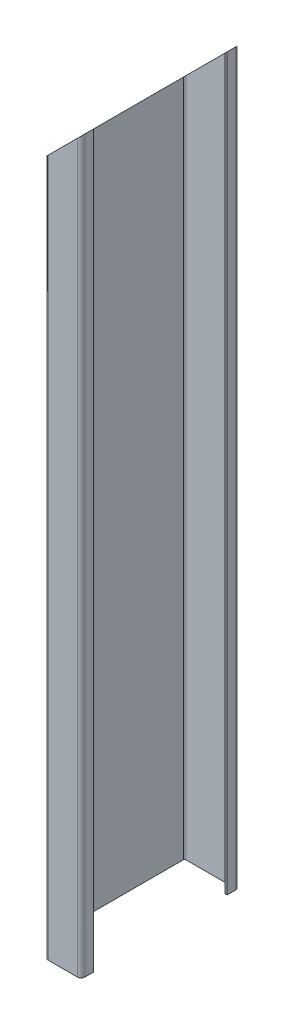
ISO-10303-21;
HEADER;
FILE_DESCRIPTION(('STEP AP214'),'2;1');
FILE_NAME('part.step','',(''),(''),'','','');
FILE_SCHEMA(('AUTOMOTIVE_DESIGN { 1 0 10303 214 1 1 1 1 }'));
ENDSEC;
DATA;
#1=APPLICATION_CONTEXT('core data for automotive mechanical design processes');
#2=APPLICATION_PROTOCOL_DEFINITION('international standard','automotive_design',2000,#1);
#3=PRODUCT_CONTEXT('',#1,'mechanical');
#4=PRODUCT('Part','Part','',(#3));
#5=PRODUCT_RELATED_PRODUCT_CATEGORY('part','',(#4));
#6=PRODUCT_DEFINITION_FORMATION('','',#4);
#7=PRODUCT_DEFINITION_CONTEXT('part definition',#1,'design');
#8=PRODUCT_DEFINITION('design','',#6,#7);
#9=PRODUCT_DEFINITION_SHAPE('','',#8);
#10=(LENGTH_UNIT() NAMED_UNIT(*) SI_UNIT(.MILLI.,.METRE.));
#11=(NAMED_UNIT(*) PLANE_ANGLE_UNIT() SI_UNIT($,.RADIAN.));
#12=(NAMED_UNIT(*) SI_UNIT($,.STERADIAN.) SOLID_ANGLE_UNIT());
#13=UNCERTAINTY_MEASURE_WITH_UNIT(LENGTH_MEASURE(1.E-05),#10,'distance_accuracy_value','');
#14=(GEOMETRIC_REPRESENTATION_CONTEXT(3) GLOBAL_UNCERTAINTY_ASSIGNED_CONTEXT((#13)) GLOBAL_UNIT_ASSIGNED_CONTEXT((#10,
#11,#12)) REPRESENTATION_CONTEXT('',''));
#15=CARTESIAN_POINT('',(0.,0.,0.));
#16=DIRECTION('',(0.,0.,1.));
#17=DIRECTION('',(1.,0.,0.));
#18=AXIS2_PLACEMENT_3D('',#15,#16,#17);
#19=CARTESIAN_POINT('',(20.5,600.,-62.));
#20=DIRECTION('',(1.,0.,0.));
#21=DIRECTION('',(0.,0.,-1.));
#22=AXIS2_PLACEMENT_3D('',#19,#20,#21);
#23=PLANE('',#22);
#24=DIRECTION('',(0.,-1.,0.));
#25=VECTOR('',#24,1.);
#26=CARTESIAN_POINT('',(20.5,600.,-55.));
#27=LINE('',#26,#25);
#28=CARTESIAN_POINT('',(20.5,598.,-55.));
#29=VERTEX_POINT('',#28);
#30=CARTESIAN_POINT('',(20.5,0.,-55.));
#31=VERTEX_POINT('',#30);
#32=EDGE_CURVE('E11',#29,#31,#27,.T.);
#33=ORIENTED_EDGE('',*,*,#32,.F.);
#34=DIRECTION('',(0.,0.,-1.));
#35=VECTOR('',#34,1.);
#36=CARTESIAN_POINT('',(20.5,598.,-62.));
#37=LINE('',#36,#35);
#38=CARTESIAN_POINT('',(20.5,598.,-62.));
#39=VERTEX_POINT('',#38);
#40=EDGE_CURVE('E512',#29,#39,#37,.T.);
#41=ORIENTED_EDGE('',*,*,#40,.T.);
#42=DIRECTION('',(0.,-1.,0.));
#43=VECTOR('',#42,1.);
#44=CARTESIAN_POINT('',(20.5,600.,-62.));
#45=LINE('',#44,#43);
#46=CARTESIAN_POINT('',(20.5,0.,-62.));
#47=VERTEX_POINT('',#46);
#48=EDGE_CURVE('E152',#39,#47,#45,.T.);
#49=ORIENTED_EDGE('',*,*,#48,.T.);
#50=DIRECTION('',(0.,0.,-1.));
#51=VECTOR('',#50,1.);
#52=CARTESIAN_POINT('',(20.5,0.,-62.));
#53=LINE('',#52,#51);
#54=EDGE_CURVE('E166',#47,#31,#53,.F.);
#55=ORIENTED_EDGE('',*,*,#54,.T.);
#56=EDGE_LOOP('',(#33,#41,#49,#55));
#57=FACE_BOUND('',#56,.T.);
#58=ADVANCED_FACE('F35',(#57),#23,.F.);
#59=CARTESIAN_POINT('',(22.5,600.,-55.));
#60=DIRECTION('',(0.,0.,1.));
#61=DIRECTION('',(1.,0.,0.));
#62=AXIS2_PLACEMENT_3D('',#59,#60,#61);
#63=PLANE('',#62);
#64=DIRECTION('',(0.707106781186547,0.707106781186548,0.));
#65=VECTOR('',#64,1.);
#66=CARTESIAN_POINT('',(22.5,600.,-55.));
#67=LINE('',#66,#65);
#68=CARTESIAN_POINT('',(22.5,600.,-55.));
#69=VERTEX_POINT('',#68);
#70=EDGE_CURVE('E513',#29,#69,#67,.T.);
#71=ORIENTED_EDGE('',*,*,#70,.F.);
#72=ORIENTED_EDGE('',*,*,#32,.T.);
#73=DIRECTION('',(-1.,0.,0.));
#74=VECTOR('',#73,1.);
#75=CARTESIAN_POINT('',(22.5,0.,-55.));
#76=LINE('',#75,#74);
#77=CARTESIAN_POINT('',(22.5,0.,-55.));
#78=VERTEX_POINT('',#77);
#79=EDGE_CURVE('E234',#78,#31,#76,.T.);
#80=ORIENTED_EDGE('',*,*,#79,.F.);
#81=DIRECTION('',(0.,-1.,0.));
#82=VECTOR('',#81,1.);
#83=CARTESIAN_POINT('',(22.5,600.,-55.));
#84=LINE('',#83,#82);
#85=EDGE_CURVE('E43',#69,#78,#84,.T.);
#86=ORIENTED_EDGE('',*,*,#85,.F.);
#87=EDGE_LOOP('',(#71,#72,#80,#86));
#88=FACE_BOUND('',#87,.T.);
#89=ADVANCED_FACE('F235',(#88),#63,.T.);
#90=CARTESIAN_POINT('',(22.5,600.,-62.));
#91=DIRECTION('',(1.,0.,0.));
#92=DIRECTION('',(0.,0.,-1.));
#93=AXIS2_PLACEMENT_3D('',#90,#91,#92);
#94=PLANE('',#93);
#95=DIRECTION('',(0.,0.,1.));
#96=VECTOR('',#95,1.);
#97=CARTESIAN_POINT('',(22.5,0.,-62.));
#98=LINE('',#97,#96);
#99=CARTESIAN_POINT('',(22.5,0.,-62.));
#100=VERTEX_POINT('',#99);
#101=EDGE_CURVE('E228',#100,#78,#98,.T.);
#102=ORIENTED_EDGE('',*,*,#101,.F.);
#103=DIRECTION('',(0.,-1.,0.));
#104=VECTOR('',#103,1.);
#105=CARTESIAN_POINT('',(22.5,600.,-62.));
#106=LINE('',#105,#104);
#107=CARTESIAN_POINT('',(22.5,600.,-62.));
#108=VERTEX_POINT('',#107);
#109=EDGE_CURVE('E220',#108,#100,#106,.T.);
#110=ORIENTED_EDGE('',*,*,#109,.F.);
#111=DIRECTION('',(0.,0.,1.));
#112=VECTOR('',#111,1.);
#113=CARTESIAN_POINT('',(22.5,600.,-62.));
#114=LINE('',#113,#112);
#115=EDGE_CURVE('E167',#108,#69,#114,.T.);
#116=ORIENTED_EDGE('',*,*,#115,.T.);
#117=ORIENTED_EDGE('',*,*,#85,.T.);
#118=EDGE_LOOP('',(#102,#110,#116,#117));
#119=FACE_BOUND('',#118,.T.);
#120=ADVANCED_FACE('F225',(#119),#94,.T.);
#121=CARTESIAN_POINT('',(19.5,600.,-62.));
#122=DIRECTION('',(0.,-1.,0.));
#123=DIRECTION('',(0.,0.,-1.));
#124=AXIS2_PLACEMENT_3D('',#121,#122,#123);
#125=CYLINDRICAL_SURFACE('',#124,3.);
#126=CARTESIAN_POINT('',(19.5,597.,-62.));
#127=DIRECTION('',(0.707106781186548,-0.707106781186547,0.));
#128=DIRECTION('',(-0.707106781186547,-0.707106781186548,0.));
#129=AXIS2_PLACEMENT_3D('',#126,#127,#128);
#130=ELLIPSE('',#129,4.24264068711929,3.);
#131=CARTESIAN_POINT('',(19.5,597.,-65.));
#132=VERTEX_POINT('',#131);
#133=EDGE_CURVE('E464',#108,#132,#130,.F.);
#134=ORIENTED_EDGE('',*,*,#133,.F.);
#135=ORIENTED_EDGE('',*,*,#109,.T.);
#136=CARTESIAN_POINT('',(19.5,0.,-62.));
#137=DIRECTION('',(0.,-1.,0.));
#138=DIRECTION('',(0.,0.,-1.));
#139=AXIS2_PLACEMENT_3D('',#136,#137,#138);
#140=CIRCLE('',#139,3.);
#141=CARTESIAN_POINT('',(19.5,0.,-65.));
#142=VERTEX_POINT('',#141);
#143=EDGE_CURVE('E240',#142,#100,#140,.T.);
#144=ORIENTED_EDGE('',*,*,#143,.F.);
#145=DIRECTION('',(0.,-1.,0.));
#146=VECTOR('',#145,1.);
#147=CARTESIAN_POINT('',(19.5,600.,-65.));
#148=LINE('',#147,#146);
#149=EDGE_CURVE('E218',#132,#142,#148,.T.);
#150=ORIENTED_EDGE('',*,*,#149,.F.);
#151=EDGE_LOOP('',(#134,#135,#144,#150));
#152=FACE_BOUND('',#151,.T.);
#153=ADVANCED_FACE('F461',(#152),#125,.T.);
#154=CARTESIAN_POINT('',(-19.5,600.,-65.));
#155=DIRECTION('',(0.,0.,-1.));
#156=DIRECTION('',(-1.,0.,0.));
#157=AXIS2_PLACEMENT_3D('',#154,#155,#156);
#158=PLANE('',#157);
#159=DIRECTION('',(0.707106781186547,0.707106781186548,0.));
#160=VECTOR('',#159,1.);
#161=CARTESIAN_POINT('',(-22.5,555.,-65.));
#162=LINE('',#161,#160);
#163=CARTESIAN_POINT('',(-19.5,558.,-65.));
#164=VERTEX_POINT('',#163);
#165=EDGE_CURVE('E458',#164,#132,#162,.T.);
#166=ORIENTED_EDGE('',*,*,#165,.T.);
#167=ORIENTED_EDGE('',*,*,#149,.T.);
#168=DIRECTION('',(1.,0.,0.));
#169=VECTOR('',#168,1.);
#170=CARTESIAN_POINT('',(-19.5,0.,-65.));
#171=LINE('',#170,#169);
#172=CARTESIAN_POINT('',(-19.5,0.,-65.));
#173=VERTEX_POINT('',#172);
#174=EDGE_CURVE('E242',#173,#142,#171,.T.);
#175=ORIENTED_EDGE('',*,*,#174,.F.);
#176=DIRECTION('',(0.,-1.,0.));
#177=VECTOR('',#176,1.);
#178=CARTESIAN_POINT('',(-19.5,600.,-65.));
#179=LINE('',#178,#177);
#180=EDGE_CURVE('E216',#164,#173,#179,.T.);
#181=ORIENTED_EDGE('',*,*,#180,.F.);
#182=EDGE_LOOP('',(#166,#167,#175,#181));
#183=FACE_BOUND('',#182,.T.);
#184=ADVANCED_FACE('F453',(#183),#158,.T.);
#185=CARTESIAN_POINT('',(-19.5,600.,-62.));
#186=DIRECTION('',(0.,-1.,0.));
#187=DIRECTION('',(0.,0.,-1.));
#188=AXIS2_PLACEMENT_3D('',#185,#186,#187);
#189=CYLINDRICAL_SURFACE('',#188,3.);
#190=CARTESIAN_POINT('',(-19.5,558.,-62.));
#191=DIRECTION('',(0.707106781186548,-0.707106781186547,0.));
#192=DIRECTION('',(-0.707106781186547,-0.707106781186548,0.));
#193=AXIS2_PLACEMENT_3D('',#190,#191,#192);
#194=ELLIPSE('',#193,4.24264068711929,3.);
#195=CARTESIAN_POINT('',(-22.5,555.,-62.));
#196=VERTEX_POINT('',#195);
#197=EDGE_CURVE('E502',#164,#196,#194,.F.);
#198=ORIENTED_EDGE('',*,*,#197,.F.);
#199=ORIENTED_EDGE('',*,*,#180,.T.);
#200=CARTESIAN_POINT('',(-19.5,0.,-62.));
#201=DIRECTION('',(0.,-1.,0.));
#202=DIRECTION('',(0.,0.,-1.));
#203=AXIS2_PLACEMENT_3D('',#200,#201,#202);
#204=CIRCLE('',#203,3.);
#205=CARTESIAN_POINT('',(-22.5,0.,-62.));
#206=VERTEX_POINT('',#205);
#207=EDGE_CURVE('E247',#206,#173,#204,.T.);
#208=ORIENTED_EDGE('',*,*,#207,.F.);
#209=DIRECTION('',(0.,-1.,0.));
#210=VECTOR('',#209,1.);
#211=CARTESIAN_POINT('',(-22.5,600.,-62.));
#212=LINE('',#211,#210);
#213=EDGE_CURVE('E214',#196,#206,#212,.T.);
#214=ORIENTED_EDGE('',*,*,#213,.F.);
#215=EDGE_LOOP('',(#198,#199,#208,#214));
#216=FACE_BOUND('',#215,.T.);
#217=ADVANCED_FACE('F448',(#216),#189,.T.);
#218=CARTESIAN_POINT('',(-22.5,600.,27.));
#219=DIRECTION('',(-1.,0.,0.));
#220=DIRECTION('',(0.,0.,1.));
#221=AXIS2_PLACEMENT_3D('',#218,#219,#220);
#222=PLANE('',#221);
#223=DIRECTION('',(0.,0.,1.));
#224=VECTOR('',#223,1.);
#225=CARTESIAN_POINT('',(-22.5,555.,-128.639610306789));
#226=LINE('',#225,#224);
#227=CARTESIAN_POINT('',(-22.5,555.,27.));
#228=VERTEX_POINT('',#227);
#229=EDGE_CURVE('E445',#196,#228,#226,.T.);
#230=ORIENTED_EDGE('',*,*,#229,.F.);
#231=ORIENTED_EDGE('',*,*,#213,.T.);
#232=DIRECTION('',(0.,0.,-1.));
#233=VECTOR('',#232,1.);
#234=CARTESIAN_POINT('',(-22.5,0.,27.));
#235=LINE('',#234,#233);
#236=CARTESIAN_POINT('',(-22.5,0.,27.));
#237=VERTEX_POINT('',#236);
#238=EDGE_CURVE('E250',#237,#206,#235,.T.);
#239=ORIENTED_EDGE('',*,*,#238,.F.);
#240=DIRECTION('',(0.,-1.,0.));
#241=VECTOR('',#240,1.);
#242=CARTESIAN_POINT('',(-22.5,600.,27.));
#243=LINE('',#242,#241);
#244=EDGE_CURVE('E212',#228,#237,#243,.T.);
#245=ORIENTED_EDGE('',*,*,#244,.F.);
#246=EDGE_LOOP('',(#230,#231,#239,#245));
#247=FACE_BOUND('',#246,.T.);
#248=ADVANCED_FACE('F440',(#247),#222,.T.);
#249=CARTESIAN_POINT('',(-19.5,600.,27.));
#250=DIRECTION('',(0.,-1.,0.));
#251=DIRECTION('',(0.,0.,-1.));
#252=AXIS2_PLACEMENT_3D('',#249,#250,#251);
#253=CYLINDRICAL_SURFACE('',#252,3.);
#254=CARTESIAN_POINT('',(-19.5,558.,27.));
#255=DIRECTION('',(0.707106781186548,-0.707106781186547,0.));
#256=DIRECTION('',(-0.707106781186547,-0.707106781186548,0.));
#257=AXIS2_PLACEMENT_3D('',#254,#255,#256);
#258=ELLIPSE('',#257,4.24264068711929,3.);
#259=CARTESIAN_POINT('',(-19.5,558.,30.));
#260=VERTEX_POINT('',#259);
#261=EDGE_CURVE('E437',#228,#260,#258,.F.);
#262=ORIENTED_EDGE('',*,*,#261,.F.);
#263=ORIENTED_EDGE('',*,*,#244,.T.);
#264=CARTESIAN_POINT('',(-19.5,0.,27.));
#265=DIRECTION('',(0.,-1.,0.));
#266=DIRECTION('',(0.,0.,-1.));
#267=AXIS2_PLACEMENT_3D('',#264,#265,#266);
#268=CIRCLE('',#267,3.);
#269=CARTESIAN_POINT('',(-19.5,0.,30.));
#270=VERTEX_POINT('',#269);
#271=EDGE_CURVE('E253',#270,#237,#268,.T.);
#272=ORIENTED_EDGE('',*,*,#271,.F.);
#273=DIRECTION('',(0.,-1.,0.));
#274=VECTOR('',#273,1.);
#275=CARTESIAN_POINT('',(-19.5,600.,30.));
#276=LINE('',#275,#274);
#277=EDGE_CURVE('E210',#260,#270,#276,.T.);
#278=ORIENTED_EDGE('',*,*,#277,.F.);
#279=EDGE_LOOP('',(#262,#263,#272,#278));
#280=FACE_BOUND('',#279,.T.);
#281=ADVANCED_FACE('F433',(#280),#253,.T.);
#282=CARTESIAN_POINT('',(-8.5,600.,30.));
#283=DIRECTION('',(0.,0.,1.));
#284=DIRECTION('',(1.,0.,0.));
#285=AXIS2_PLACEMENT_3D('',#282,#283,#284);
#286=PLANE('',#285);
#287=DIRECTION('',(0.707106781186547,0.707106781186548,0.));
#288=VECTOR('',#287,1.);
#289=CARTESIAN_POINT('',(7.00000000000001,584.5,30.));
#290=LINE('',#289,#288);
#291=CARTESIAN_POINT('',(-8.5,569.,30.));
#292=VERTEX_POINT('',#291);
#293=EDGE_CURVE('E499',#260,#292,#290,.T.);
#294=ORIENTED_EDGE('',*,*,#293,.F.);
#295=ORIENTED_EDGE('',*,*,#277,.T.);
#296=DIRECTION('',(-1.,0.,0.));
#297=VECTOR('',#296,1.);
#298=CARTESIAN_POINT('',(-8.5,0.,30.));
#299=LINE('',#298,#297);
#300=CARTESIAN_POINT('',(-8.5,0.,30.));
#301=VERTEX_POINT('',#300);
#302=EDGE_CURVE('E256',#301,#270,#299,.T.);
#303=ORIENTED_EDGE('',*,*,#302,.F.);
#304=DIRECTION('',(0.,-1.,0.));
#305=VECTOR('',#304,1.);
#306=CARTESIAN_POINT('',(-8.5,600.,30.));
#307=LINE('',#306,#305);
#308=EDGE_CURVE('E208',#292,#301,#307,.T.);
#309=ORIENTED_EDGE('',*,*,#308,.F.);
#310=EDGE_LOOP('',(#294,#295,#303,#309));
#311=FACE_BOUND('',#310,.T.);
#312=ADVANCED_FACE('F427',(#311),#286,.T.);
#313=CARTESIAN_POINT('',(-8.5,600.,31.));
#314=DIRECTION('',(0.,-1.,0.));
#315=DIRECTION('',(0.,0.,-1.));
#316=AXIS2_PLACEMENT_3D('',#313,#314,#315);
#317=CYLINDRICAL_SURFACE('',#316,1.);
#318=CARTESIAN_POINT('',(-8.5,569.,31.));
#319=DIRECTION('',(0.707106781186548,-0.707106781186547,0.));
#320=DIRECTION('',(-0.707106781186547,-0.707106781186548,0.));
#321=AXIS2_PLACEMENT_3D('',#318,#319,#320);
#322=ELLIPSE('',#321,1.4142135623731,1.);
#323=CARTESIAN_POINT('',(-7.5,570.,31.));
#324=VERTEX_POINT('',#323);
#325=EDGE_CURVE('E424',#292,#324,#322,.T.);
#326=ORIENTED_EDGE('',*,*,#325,.F.);
#327=ORIENTED_EDGE('',*,*,#308,.T.);
#328=CARTESIAN_POINT('',(-8.5,0.,31.));
#329=DIRECTION('',(0.,1.,0.));
#330=DIRECTION('',(0.,0.,1.));
#331=AXIS2_PLACEMENT_3D('',#328,#329,#330);
#332=CIRCLE('',#331,1.);
#333=CARTESIAN_POINT('',(-7.5,0.,31.));
#334=VERTEX_POINT('',#333);
#335=EDGE_CURVE('E259',#334,#301,#332,.T.);
#336=ORIENTED_EDGE('',*,*,#335,.F.);
#337=DIRECTION('',(0.,-1.,0.));
#338=VECTOR('',#337,1.);
#339=CARTESIAN_POINT('',(-7.5,600.,31.));
#340=LINE('',#339,#338);
#341=EDGE_CURVE('E206',#324,#334,#340,.T.);
#342=ORIENTED_EDGE('',*,*,#341,.F.);
#343=EDGE_LOOP('',(#326,#327,#336,#342));
#344=FACE_BOUND('',#343,.T.);
#345=ADVANCED_FACE('F419',(#344),#317,.F.);
#346=CARTESIAN_POINT('',(-7.5,600.,62.));
#347=DIRECTION('',(-1.,0.,0.));
#348=DIRECTION('',(0.,0.,1.));
#349=AXIS2_PLACEMENT_3D('',#346,#347,#348);
#350=PLANE('',#349);
#351=DIRECTION('',(0.,0.,1.));
#352=VECTOR('',#351,1.);
#353=CARTESIAN_POINT('',(-7.5,570.,62.));
#354=LINE('',#353,#352);
#355=CARTESIAN_POINT('',(-7.50000000000001,570.,62.));
#356=VERTEX_POINT('',#355);
#357=EDGE_CURVE('E416',#324,#356,#354,.T.);
#358=ORIENTED_EDGE('',*,*,#357,.F.);
#359=ORIENTED_EDGE('',*,*,#341,.T.);
#360=DIRECTION('',(0.,0.,-1.));
#361=VECTOR('',#360,1.);
#362=CARTESIAN_POINT('',(-7.5,0.,62.));
#363=LINE('',#362,#361);
#364=CARTESIAN_POINT('',(-7.50000000000001,0.,62.));
#365=VERTEX_POINT('',#364);
#366=EDGE_CURVE('E262',#365,#334,#363,.T.);
#367=ORIENTED_EDGE('',*,*,#366,.F.);
#368=DIRECTION('',(0.,-1.,0.));
#369=VECTOR('',#368,1.);
#370=CARTESIAN_POINT('',(-7.50000000000001,600.,62.));
#371=LINE('',#370,#369);
#372=EDGE_CURVE('E204',#356,#365,#371,.T.);
#373=ORIENTED_EDGE('',*,*,#372,.F.);
#374=EDGE_LOOP('',(#358,#359,#367,#373));
#375=FACE_BOUND('',#374,.T.);
#376=ADVANCED_FACE('F411',(#375),#350,.T.);
#377=CARTESIAN_POINT('',(-4.5,600.,62.));
#378=DIRECTION('',(0.,-1.,0.));
#379=DIRECTION('',(0.,0.,-1.));
#380=AXIS2_PLACEMENT_3D('',#377,#378,#379);
#381=CYLINDRICAL_SURFACE('',#380,3.);
#382=CARTESIAN_POINT('',(-4.5,573.,62.));
#383=DIRECTION('',(0.707106781186548,-0.707106781186547,0.));
#384=DIRECTION('',(-0.707106781186547,-0.707106781186548,0.));
#385=AXIS2_PLACEMENT_3D('',#382,#383,#384);
#386=ELLIPSE('',#385,4.24264068711929,3.);
#387=CARTESIAN_POINT('',(-4.50000000000001,573.,65.));
#388=VERTEX_POINT('',#387);
#389=EDGE_CURVE('E521',#356,#388,#386,.F.);
#390=ORIENTED_EDGE('',*,*,#389,.F.);
#391=ORIENTED_EDGE('',*,*,#372,.T.);
#392=CARTESIAN_POINT('',(-4.5,0.,62.));
#393=DIRECTION('',(0.,-1.,0.));
#394=DIRECTION('',(0.,0.,-1.));
#395=AXIS2_PLACEMENT_3D('',#392,#393,#394);
#396=CIRCLE('',#395,3.);
#397=CARTESIAN_POINT('',(-4.5,0.,65.));
#398=VERTEX_POINT('',#397);
#399=EDGE_CURVE('E265',#398,#365,#396,.T.);
#400=ORIENTED_EDGE('',*,*,#399,.F.);
#401=DIRECTION('',(0.,-1.,0.));
#402=VECTOR('',#401,1.);
#403=CARTESIAN_POINT('',(-4.5,600.,65.));
#404=LINE('',#403,#402);
#405=EDGE_CURVE('E202',#388,#398,#404,.T.);
#406=ORIENTED_EDGE('',*,*,#405,.F.);
#407=EDGE_LOOP('',(#390,#391,#400,#406));
#408=FACE_BOUND('',#407,.T.);
#409=ADVANCED_FACE('F405',(#408),#381,.T.);
#410=CARTESIAN_POINT('',(19.5,600.,65.));
#411=DIRECTION('',(0.,0.,1.));
#412=DIRECTION('',(1.,0.,0.));
#413=AXIS2_PLACEMENT_3D('',#410,#411,#412);
#414=PLANE('',#413);
#415=DIRECTION('',(0.707106781186547,0.707106781186548,0.));
#416=VECTOR('',#415,1.);
#417=CARTESIAN_POINT('',(-22.5,555.,65.));
#418=LINE('',#417,#416);
#419=CARTESIAN_POINT('',(19.5,597.,65.));
#420=VERTEX_POINT('',#419);
#421=EDGE_CURVE('E402',#388,#420,#418,.T.);
#422=ORIENTED_EDGE('',*,*,#421,.F.);
#423=ORIENTED_EDGE('',*,*,#405,.T.);
#424=DIRECTION('',(-1.,0.,0.));
#425=VECTOR('',#424,1.);
#426=CARTESIAN_POINT('',(19.5,0.,65.));
#427=LINE('',#426,#425);
#428=CARTESIAN_POINT('',(19.5,0.,65.));
#429=VERTEX_POINT('',#428);
#430=EDGE_CURVE('E268',#429,#398,#427,.T.);
#431=ORIENTED_EDGE('',*,*,#430,.F.);
#432=DIRECTION('',(0.,-1.,0.));
#433=VECTOR('',#432,1.);
#434=CARTESIAN_POINT('',(19.5,600.,65.));
#435=LINE('',#434,#433);
#436=EDGE_CURVE('E200',#420,#429,#435,.T.);
#437=ORIENTED_EDGE('',*,*,#436,.F.);
#438=EDGE_LOOP('',(#422,#423,#431,#437));
#439=FACE_BOUND('',#438,.T.);
#440=ADVANCED_FACE('F398',(#439),#414,.T.);
#441=CARTESIAN_POINT('',(19.5,600.,62.));
#442=DIRECTION('',(0.,-1.,0.));
#443=DIRECTION('',(0.,0.,-1.));
#444=AXIS2_PLACEMENT_3D('',#441,#442,#443);
#445=CYLINDRICAL_SURFACE('',#444,3.);
#446=CARTESIAN_POINT('',(19.5,597.,62.));
#447=DIRECTION('',(0.707106781186548,-0.707106781186547,0.));
#448=DIRECTION('',(-0.707106781186547,-0.707106781186548,0.));
#449=AXIS2_PLACEMENT_3D('',#446,#447,#448);
#450=ELLIPSE('',#449,4.24264068711929,3.);
#451=CARTESIAN_POINT('',(22.5,600.,62.));
#452=VERTEX_POINT('',#451);
#453=EDGE_CURVE('E50',#420,#452,#450,.F.);
#454=ORIENTED_EDGE('',*,*,#453,.F.);
#455=ORIENTED_EDGE('',*,*,#436,.T.);
#456=CARTESIAN_POINT('',(19.5,0.,62.));
#457=DIRECTION('',(0.,-1.,0.));
#458=DIRECTION('',(0.,0.,-1.));
#459=AXIS2_PLACEMENT_3D('',#456,#457,#458);
#460=CIRCLE('',#459,3.);
#461=CARTESIAN_POINT('',(22.5,0.,62.));
#462=VERTEX_POINT('',#461);
#463=EDGE_CURVE('E271',#462,#429,#460,.T.);
#464=ORIENTED_EDGE('',*,*,#463,.F.);
#465=DIRECTION('',(0.,-1.,0.));
#466=VECTOR('',#465,1.);
#467=CARTESIAN_POINT('',(22.5,600.,62.));
#468=LINE('',#467,#466);
#469=EDGE_CURVE('E198',#452,#462,#468,.T.);
#470=ORIENTED_EDGE('',*,*,#469,.F.);
#471=EDGE_LOOP('',(#454,#455,#464,#470));
#472=FACE_BOUND('',#471,.T.);
#473=ADVANCED_FACE('F393',(#472),#445,.T.);
#474=CARTESIAN_POINT('',(22.5,600.,55.));
#475=DIRECTION('',(1.,0.,0.));
#476=DIRECTION('',(0.,0.,-1.));
#477=AXIS2_PLACEMENT_3D('',#474,#475,#476);
#478=PLANE('',#477);
#479=DIRECTION('',(0.,0.,1.));
#480=VECTOR('',#479,1.);
#481=CARTESIAN_POINT('',(22.5,0.,55.));
#482=LINE('',#481,#480);
#483=CARTESIAN_POINT('',(22.5,0.,55.));
#484=VERTEX_POINT('',#483);
#485=EDGE_CURVE('E274',#484,#462,#482,.T.);
#486=ORIENTED_EDGE('',*,*,#485,.F.);
#487=DIRECTION('',(0.,-1.,0.));
#488=VECTOR('',#487,1.);
#489=CARTESIAN_POINT('',(22.5,600.,55.));
#490=LINE('',#489,#488);
#491=CARTESIAN_POINT('',(22.5,600.,55.));
#492=VERTEX_POINT('',#491);
#493=EDGE_CURVE('E196',#492,#484,#490,.T.);
#494=ORIENTED_EDGE('',*,*,#493,.F.);
#495=DIRECTION('',(0.,0.,1.));
#496=VECTOR('',#495,1.);
#497=CARTESIAN_POINT('',(22.5,600.,55.));
#498=LINE('',#497,#496);
#499=EDGE_CURVE('E170',#492,#452,#498,.T.);
#500=ORIENTED_EDGE('',*,*,#499,.T.);
#501=ORIENTED_EDGE('',*,*,#469,.T.);
#502=EDGE_LOOP('',(#486,#494,#500,#501));
#503=FACE_BOUND('',#502,.T.);
#504=ADVANCED_FACE('F389',(#503),#478,.T.);
#505=CARTESIAN_POINT('',(20.5,600.,55.));
#506=DIRECTION('',(0.,0.,-1.));
#507=DIRECTION('',(-1.,0.,0.));
#508=AXIS2_PLACEMENT_3D('',#505,#506,#507);
#509=PLANE('',#508);
#510=DIRECTION('',(-0.707106781186547,-0.707106781186548,0.));
#511=VECTOR('',#510,1.);
#512=CARTESIAN_POINT('',(21.5,599.,55.));
#513=LINE('',#512,#511);
#514=CARTESIAN_POINT('',(20.5,598.,55.));
#515=VERTEX_POINT('',#514);
#516=EDGE_CURVE('E386',#492,#515,#513,.T.);
#517=ORIENTED_EDGE('',*,*,#516,.F.);
#518=ORIENTED_EDGE('',*,*,#493,.T.);
#519=DIRECTION('',(1.,0.,0.));
#520=VECTOR('',#519,1.);
#521=CARTESIAN_POINT('',(20.5,0.,55.));
#522=LINE('',#521,#520);
#523=CARTESIAN_POINT('',(20.5,0.,55.));
#524=VERTEX_POINT('',#523);
#525=EDGE_CURVE('E277',#524,#484,#522,.T.);
#526=ORIENTED_EDGE('',*,*,#525,.F.);
#527=DIRECTION('',(0.,-1.,0.));
#528=VECTOR('',#527,1.);
#529=CARTESIAN_POINT('',(20.5,600.,55.));
#530=LINE('',#529,#528);
#531=EDGE_CURVE('E194',#515,#524,#530,.T.);
#532=ORIENTED_EDGE('',*,*,#531,.F.);
#533=EDGE_LOOP('',(#517,#518,#526,#532));
#534=FACE_BOUND('',#533,.T.);
#535=ADVANCED_FACE('F380',(#534),#509,.T.);
#536=CARTESIAN_POINT('',(20.5,600.,55.));
#537=DIRECTION('',(1.,0.,0.));
#538=DIRECTION('',(0.,0.,-1.));
#539=AXIS2_PLACEMENT_3D('',#536,#537,#538);
#540=PLANE('',#539);
#541=DIRECTION('',(0.,-1.,0.));
#542=VECTOR('',#541,1.);
#543=CARTESIAN_POINT('',(20.5,600.,62.));
#544=LINE('',#543,#542);
#545=CARTESIAN_POINT('',(20.5,598.,62.));
#546=VERTEX_POINT('',#545);
#547=CARTESIAN_POINT('',(20.5,0.,62.));
#548=VERTEX_POINT('',#547);
#549=EDGE_CURVE('E192',#546,#548,#544,.T.);
#550=ORIENTED_EDGE('',*,*,#549,.F.);
#551=DIRECTION('',(0.,0.,-1.));
#552=VECTOR('',#551,1.);
#553=CARTESIAN_POINT('',(20.5,598.,55.));
#554=LINE('',#553,#552);
#555=EDGE_CURVE('E516',#546,#515,#554,.T.);
#556=ORIENTED_EDGE('',*,*,#555,.T.);
#557=ORIENTED_EDGE('',*,*,#531,.T.);
#558=DIRECTION('',(0.,0.,-1.));
#559=VECTOR('',#558,1.);
#560=CARTESIAN_POINT('',(20.5,0.,55.));
#561=LINE('',#560,#559);
#562=EDGE_CURVE('E280',#524,#548,#561,.F.);
#563=ORIENTED_EDGE('',*,*,#562,.T.);
#564=EDGE_LOOP('',(#550,#556,#557,#563));
#565=FACE_BOUND('',#564,.T.);
#566=ADVANCED_FACE('F375',(#565),#540,.F.);
#567=CARTESIAN_POINT('',(19.5,600.,62.));
#568=DIRECTION('',(0.,-1.,0.));
#569=DIRECTION('',(0.,0.,-1.));
#570=AXIS2_PLACEMENT_3D('',#567,#568,#569);
#571=CYLINDRICAL_SURFACE('',#570,1.);
#572=DIRECTION('',(0.,-1.,0.));
#573=VECTOR('',#572,1.);
#574=CARTESIAN_POINT('',(19.5,600.,63.));
#575=LINE('',#574,#573);
#576=CARTESIAN_POINT('',(19.5,597.,63.));
#577=VERTEX_POINT('',#576);
#578=CARTESIAN_POINT('',(19.5,0.,63.));
#579=VERTEX_POINT('',#578);
#580=EDGE_CURVE('E190',#577,#579,#575,.T.);
#581=ORIENTED_EDGE('',*,*,#580,.F.);
#582=CARTESIAN_POINT('',(19.5,597.,62.));
#583=DIRECTION('',(0.707106781186548,-0.707106781186547,0.));
#584=DIRECTION('',(-0.707106781186547,-0.707106781186548,0.));
#585=AXIS2_PLACEMENT_3D('',#582,#583,#584);
#586=ELLIPSE('',#585,1.4142135623731,1.);
#587=EDGE_CURVE('E372',#577,#546,#586,.F.);
#588=ORIENTED_EDGE('',*,*,#587,.T.);
#589=ORIENTED_EDGE('',*,*,#549,.T.);
#590=CARTESIAN_POINT('',(19.5,0.,62.));
#591=DIRECTION('',(0.,1.,0.));
#592=DIRECTION('',(1.,0.,0.));
#593=AXIS2_PLACEMENT_3D('',#590,#591,#592);
#594=CIRCLE('',#593,1.);
#595=EDGE_CURVE('E283',#548,#579,#594,.F.);
#596=ORIENTED_EDGE('',*,*,#595,.T.);
#597=EDGE_LOOP('',(#581,#588,#589,#596));
#598=FACE_BOUND('',#597,.T.);
#599=ADVANCED_FACE('F368',(#598),#571,.F.);
#600=CARTESIAN_POINT('',(19.5,600.,63.));
#601=DIRECTION('',(0.,0.,1.));
#602=DIRECTION('',(1.,0.,0.));
#603=AXIS2_PLACEMENT_3D('',#600,#601,#602);
#604=PLANE('',#603);
#605=DIRECTION('',(0.,-1.,0.));
#606=VECTOR('',#605,1.);
#607=CARTESIAN_POINT('',(-4.5,600.,63.));
#608=LINE('',#607,#606);
#609=CARTESIAN_POINT('',(-4.5,573.,63.));
#610=VERTEX_POINT('',#609);
#611=CARTESIAN_POINT('',(-4.5,0.,63.));
#612=VERTEX_POINT('',#611);
#613=EDGE_CURVE('E188',#610,#612,#608,.T.);
#614=ORIENTED_EDGE('',*,*,#613,.F.);
#615=DIRECTION('',(0.707106781186547,0.707106781186548,0.));
#616=VECTOR('',#615,1.);
#617=CARTESIAN_POINT('',(21.,598.5,63.));
#618=LINE('',#617,#616);
#619=EDGE_CURVE('E365',#610,#577,#618,.T.);
#620=ORIENTED_EDGE('',*,*,#619,.T.);
#621=ORIENTED_EDGE('',*,*,#580,.T.);
#622=DIRECTION('',(1.,0.,0.));
#623=VECTOR('',#622,1.);
#624=CARTESIAN_POINT('',(19.5,0.,63.));
#625=LINE('',#624,#623);
#626=EDGE_CURVE('E286',#579,#612,#625,.F.);
#627=ORIENTED_EDGE('',*,*,#626,.T.);
#628=EDGE_LOOP('',(#614,#620,#621,#627));
#629=FACE_BOUND('',#628,.T.);
#630=ADVANCED_FACE('F359',(#629),#604,.F.);
#631=CARTESIAN_POINT('',(-4.5,600.,62.));
#632=DIRECTION('',(0.,-1.,0.));
#633=DIRECTION('',(0.,0.,-1.));
#634=AXIS2_PLACEMENT_3D('',#631,#632,#633);
#635=CYLINDRICAL_SURFACE('',#634,1.);
#636=DIRECTION('',(0.,-1.,0.));
#637=VECTOR('',#636,1.);
#638=CARTESIAN_POINT('',(-5.5,600.,62.));
#639=LINE('',#638,#637);
#640=CARTESIAN_POINT('',(-5.5,572.,62.));
#641=VERTEX_POINT('',#640);
#642=CARTESIAN_POINT('',(-5.5,0.,62.));
#643=VERTEX_POINT('',#642);
#644=EDGE_CURVE('E186',#641,#643,#639,.T.);
#645=ORIENTED_EDGE('',*,*,#644,.F.);
#646=CARTESIAN_POINT('',(-4.5,573.,62.));
#647=DIRECTION('',(0.707106781186548,-0.707106781186547,0.));
#648=DIRECTION('',(-0.707106781186547,-0.707106781186548,0.));
#649=AXIS2_PLACEMENT_3D('',#646,#647,#648);
#650=ELLIPSE('',#649,1.4142135623731,1.);
#651=EDGE_CURVE('E537',#641,#610,#650,.F.);
#652=ORIENTED_EDGE('',*,*,#651,.T.);
#653=ORIENTED_EDGE('',*,*,#613,.T.);
#654=CARTESIAN_POINT('',(-4.5,0.,62.));
#655=DIRECTION('',(0.,1.,0.));
#656=DIRECTION('',(1.,0.,0.));
#657=AXIS2_PLACEMENT_3D('',#654,#655,#656);
#658=CIRCLE('',#657,1.);
#659=EDGE_CURVE('E289',#612,#643,#658,.F.);
#660=ORIENTED_EDGE('',*,*,#659,.T.);
#661=EDGE_LOOP('',(#645,#652,#653,#660));
#662=FACE_BOUND('',#661,.T.);
#663=ADVANCED_FACE('F353',(#662),#635,.F.);
#664=CARTESIAN_POINT('',(-5.5,600.,62.));
#665=DIRECTION('',(-1.,0.,0.));
#666=DIRECTION('',(0.,0.,1.));
#667=AXIS2_PLACEMENT_3D('',#664,#665,#666);
#668=PLANE('',#667);
#669=DIRECTION('',(0.,-1.,0.));
#670=VECTOR('',#669,1.);
#671=CARTESIAN_POINT('',(-5.5,600.,31.));
#672=LINE('',#671,#670);
#673=CARTESIAN_POINT('',(-5.5,572.,31.));
#674=VERTEX_POINT('',#673);
#675=CARTESIAN_POINT('',(-5.5,0.,31.));
#676=VERTEX_POINT('',#675);
#677=EDGE_CURVE('E184',#674,#676,#672,.T.);
#678=ORIENTED_EDGE('',*,*,#677,.F.);
#679=DIRECTION('',(0.,0.,1.));
#680=VECTOR('',#679,1.);
#681=CARTESIAN_POINT('',(-5.5,572.,62.));
#682=LINE('',#681,#680);
#683=EDGE_CURVE('E350',#674,#641,#682,.T.);
#684=ORIENTED_EDGE('',*,*,#683,.T.);
#685=ORIENTED_EDGE('',*,*,#644,.T.);
#686=DIRECTION('',(0.,0.,-1.));
#687=VECTOR('',#686,1.);
#688=CARTESIAN_POINT('',(-5.5,0.,62.));
#689=LINE('',#688,#687);
#690=EDGE_CURVE('E292',#643,#676,#689,.T.);
#691=ORIENTED_EDGE('',*,*,#690,.T.);
#692=EDGE_LOOP('',(#678,#684,#685,#691));
#693=FACE_BOUND('',#692,.T.);
#694=ADVANCED_FACE('F346',(#693),#668,.F.);
#695=CARTESIAN_POINT('',(-8.5,600.,31.));
#696=DIRECTION('',(0.,-1.,0.));
#697=DIRECTION('',(0.,0.,-1.));
#698=AXIS2_PLACEMENT_3D('',#695,#696,#697);
#699=CYLINDRICAL_SURFACE('',#698,3.);
#700=DIRECTION('',(0.,-1.,0.));
#701=VECTOR('',#700,1.);
#702=CARTESIAN_POINT('',(-8.5,600.,28.));
#703=LINE('',#702,#701);
#704=CARTESIAN_POINT('',(-8.5,569.,28.));
#705=VERTEX_POINT('',#704);
#706=CARTESIAN_POINT('',(-8.5,0.,28.));
#707=VERTEX_POINT('',#706);
#708=EDGE_CURVE('E182',#705,#707,#703,.T.);
#709=ORIENTED_EDGE('',*,*,#708,.F.);
#710=CARTESIAN_POINT('',(-8.5,569.,31.));
#711=DIRECTION('',(0.707106781186548,-0.707106781186547,0.));
#712=DIRECTION('',(-0.707106781186547,-0.707106781186548,0.));
#713=AXIS2_PLACEMENT_3D('',#710,#711,#712);
#714=ELLIPSE('',#713,4.24264068711929,3.);
#715=EDGE_CURVE('E343',#705,#674,#714,.T.);
#716=ORIENTED_EDGE('',*,*,#715,.T.);
#717=ORIENTED_EDGE('',*,*,#677,.T.);
#718=CARTESIAN_POINT('',(-8.5,0.,31.));
#719=DIRECTION('',(0.,1.,0.));
#720=DIRECTION('',(1.,0.,0.));
#721=AXIS2_PLACEMENT_3D('',#718,#719,#720);
#722=CIRCLE('',#721,3.);
#723=EDGE_CURVE('E295',#676,#707,#722,.T.);
#724=ORIENTED_EDGE('',*,*,#723,.T.);
#725=EDGE_LOOP('',(#709,#716,#717,#724));
#726=FACE_BOUND('',#725,.T.);
#727=ADVANCED_FACE('F337',(#726),#699,.T.);
#728=CARTESIAN_POINT('',(-8.5,600.,28.));
#729=DIRECTION('',(0.,0.,1.));
#730=DIRECTION('',(1.,0.,0.));
#731=AXIS2_PLACEMENT_3D('',#728,#729,#730);
#732=PLANE('',#731);
#733=DIRECTION('',(0.,-1.,0.));
#734=VECTOR('',#733,1.);
#735=CARTESIAN_POINT('',(-19.5,600.,28.));
#736=LINE('',#735,#734);
#737=CARTESIAN_POINT('',(-19.5,558.,28.));
#738=VERTEX_POINT('',#737);
#739=CARTESIAN_POINT('',(-19.5,0.,28.));
#740=VERTEX_POINT('',#739);
#741=EDGE_CURVE('E180',#738,#740,#736,.T.);
#742=ORIENTED_EDGE('',*,*,#741,.F.);
#743=DIRECTION('',(0.707106781186547,0.707106781186548,0.));
#744=VECTOR('',#743,1.);
#745=CARTESIAN_POINT('',(7.00000000000001,584.5,28.));
#746=LINE('',#745,#744);
#747=EDGE_CURVE('E533',#738,#705,#746,.T.);
#748=ORIENTED_EDGE('',*,*,#747,.T.);
#749=ORIENTED_EDGE('',*,*,#708,.T.);
#750=DIRECTION('',(1.,0.,0.));
#751=VECTOR('',#750,1.);
#752=CARTESIAN_POINT('',(-8.5,0.,28.));
#753=LINE('',#752,#751);
#754=EDGE_CURVE('E298',#707,#740,#753,.F.);
#755=ORIENTED_EDGE('',*,*,#754,.T.);
#756=EDGE_LOOP('',(#742,#748,#749,#755));
#757=FACE_BOUND('',#756,.T.);
#758=ADVANCED_FACE('F331',(#757),#732,.F.);
#759=CARTESIAN_POINT('',(-19.5,600.,27.));
#760=DIRECTION('',(0.,-1.,0.));
#761=DIRECTION('',(0.,0.,-1.));
#762=AXIS2_PLACEMENT_3D('',#759,#760,#761);
#763=CYLINDRICAL_SURFACE('',#762,0.999999999999999);
#764=DIRECTION('',(0.,-1.,0.));
#765=VECTOR('',#764,1.);
#766=CARTESIAN_POINT('',(-20.5,600.,27.));
#767=LINE('',#766,#765);
#768=CARTESIAN_POINT('',(-20.5,557.,27.));
#769=VERTEX_POINT('',#768);
#770=CARTESIAN_POINT('',(-20.5,0.,27.));
#771=VERTEX_POINT('',#770);
#772=EDGE_CURVE('E178',#769,#771,#767,.T.);
#773=ORIENTED_EDGE('',*,*,#772,.F.);
#774=CARTESIAN_POINT('',(-19.5,558.,27.));
#775=DIRECTION('',(0.707106781186548,-0.707106781186547,0.));
#776=DIRECTION('',(-0.707106781186547,-0.707106781186548,0.));
#777=AXIS2_PLACEMENT_3D('',#774,#775,#776);
#778=ELLIPSE('',#777,1.41421356237309,0.999999999999999);
#779=EDGE_CURVE('E328',#769,#738,#778,.F.);
#780=ORIENTED_EDGE('',*,*,#779,.T.);
#781=ORIENTED_EDGE('',*,*,#741,.T.);
#782=CARTESIAN_POINT('',(-19.5,0.,27.));
#783=DIRECTION('',(0.,1.,0.));
#784=DIRECTION('',(1.,0.,0.));
#785=AXIS2_PLACEMENT_3D('',#782,#783,#784);
#786=CIRCLE('',#785,0.999999999999999);
#787=EDGE_CURVE('E301',#740,#771,#786,.F.);
#788=ORIENTED_EDGE('',*,*,#787,.T.);
#789=EDGE_LOOP('',(#773,#780,#781,#788));
#790=FACE_BOUND('',#789,.T.);
#791=ADVANCED_FACE('F324',(#790),#763,.F.);
#792=CARTESIAN_POINT('',(-20.5,600.,27.));
#793=DIRECTION('',(-1.,0.,0.));
#794=DIRECTION('',(0.,0.,1.));
#795=AXIS2_PLACEMENT_3D('',#792,#793,#794);
#796=PLANE('',#795);
#797=DIRECTION('',(0.,-1.,0.));
#798=VECTOR('',#797,1.);
#799=CARTESIAN_POINT('',(-20.5,600.,-62.));
#800=LINE('',#799,#798);
#801=CARTESIAN_POINT('',(-20.5,557.,-62.));
#802=VERTEX_POINT('',#801);
#803=CARTESIAN_POINT('',(-20.5,0.,-62.));
#804=VERTEX_POINT('',#803);
#805=EDGE_CURVE('E176',#802,#804,#800,.T.);
#806=ORIENTED_EDGE('',*,*,#805,.F.);
#807=DIRECTION('',(0.,0.,1.));
#808=VECTOR('',#807,1.);
#809=CARTESIAN_POINT('',(-20.5,557.,27.));
#810=LINE('',#809,#808);
#811=EDGE_CURVE('E321',#802,#769,#810,.T.);
#812=ORIENTED_EDGE('',*,*,#811,.T.);
#813=ORIENTED_EDGE('',*,*,#772,.T.);
#814=DIRECTION('',(0.,0.,-1.));
#815=VECTOR('',#814,1.);
#816=CARTESIAN_POINT('',(-20.5,0.,27.));
#817=LINE('',#816,#815);
#818=EDGE_CURVE('E304',#771,#804,#817,.T.);
#819=ORIENTED_EDGE('',*,*,#818,.T.);
#820=EDGE_LOOP('',(#806,#812,#813,#819));
#821=FACE_BOUND('',#820,.T.);
#822=ADVANCED_FACE('F315',(#821),#796,.F.);
#823=CARTESIAN_POINT('',(-19.5,600.,-62.));
#824=DIRECTION('',(0.,-1.,0.));
#825=DIRECTION('',(0.,0.,-1.));
#826=AXIS2_PLACEMENT_3D('',#823,#824,#825);
#827=CYLINDRICAL_SURFACE('',#826,1.);
#828=DIRECTION('',(0.,-1.,0.));
#829=VECTOR('',#828,1.);
#830=CARTESIAN_POINT('',(-19.5,600.,-63.));
#831=LINE('',#830,#829);
#832=CARTESIAN_POINT('',(-19.5,558.,-63.));
#833=VERTEX_POINT('',#832);
#834=CARTESIAN_POINT('',(-19.5,0.,-63.));
#835=VERTEX_POINT('',#834);
#836=EDGE_CURVE('E151',#833,#835,#831,.T.);
#837=ORIENTED_EDGE('',*,*,#836,.F.);
#838=CARTESIAN_POINT('',(-19.5,558.,-62.));
#839=DIRECTION('',(0.707106781186548,-0.707106781186547,0.));
#840=DIRECTION('',(-0.707106781186547,-0.707106781186548,0.));
#841=AXIS2_PLACEMENT_3D('',#838,#839,#840);
#842=ELLIPSE('',#841,1.4142135623731,1.);
#843=EDGE_CURVE('E529',#833,#802,#842,.F.);
#844=ORIENTED_EDGE('',*,*,#843,.T.);
#845=ORIENTED_EDGE('',*,*,#805,.T.);
#846=CARTESIAN_POINT('',(-19.5,0.,-62.));
#847=DIRECTION('',(0.,1.,0.));
#848=DIRECTION('',(1.,0.,0.));
#849=AXIS2_PLACEMENT_3D('',#846,#847,#848);
#850=CIRCLE('',#849,1.);
#851=EDGE_CURVE('E161',#804,#835,#850,.F.);
#852=ORIENTED_EDGE('',*,*,#851,.T.);
#853=EDGE_LOOP('',(#837,#844,#845,#852));
#854=FACE_BOUND('',#853,.T.);
#855=ADVANCED_FACE('F307',(#854),#827,.F.);
#856=CARTESIAN_POINT('',(-19.5,600.,-63.));
#857=DIRECTION('',(0.,0.,-1.));
#858=DIRECTION('',(-1.,0.,0.));
#859=AXIS2_PLACEMENT_3D('',#856,#857,#858);
#860=PLANE('',#859);
#861=DIRECTION('',(0.,-1.,0.));
#862=VECTOR('',#861,1.);
#863=CARTESIAN_POINT('',(19.5,600.,-63.));
#864=LINE('',#863,#862);
#865=CARTESIAN_POINT('',(19.5,597.,-63.));
#866=VERTEX_POINT('',#865);
#867=CARTESIAN_POINT('',(19.5,0.,-63.));
#868=VERTEX_POINT('',#867);
#869=EDGE_CURVE('E139',#866,#868,#864,.T.);
#870=ORIENTED_EDGE('',*,*,#869,.F.);
#871=DIRECTION('',(-0.707106781186547,-0.707106781186548,0.));
#872=VECTOR('',#871,1.);
#873=CARTESIAN_POINT('',(1.50000000000002,579.,-63.));
#874=LINE('',#873,#872);
#875=EDGE_CURVE('E527',#866,#833,#874,.T.);
#876=ORIENTED_EDGE('',*,*,#875,.T.);
#877=ORIENTED_EDGE('',*,*,#836,.T.);
#878=DIRECTION('',(1.,0.,0.));
#879=VECTOR('',#878,1.);
#880=CARTESIAN_POINT('',(-19.5,0.,-63.));
#881=LINE('',#880,#879);
#882=EDGE_CURVE('E155',#835,#868,#881,.T.);
#883=ORIENTED_EDGE('',*,*,#882,.T.);
#884=EDGE_LOOP('',(#870,#876,#877,#883));
#885=FACE_BOUND('',#884,.T.);
#886=ADVANCED_FACE('F156',(#885),#860,.F.);
#887=CARTESIAN_POINT('',(19.5,600.,-62.));
#888=DIRECTION('',(0.,-1.,0.));
#889=DIRECTION('',(0.,0.,-1.));
#890=AXIS2_PLACEMENT_3D('',#887,#888,#889);
#891=CYLINDRICAL_SURFACE('',#890,1.);
#892=ORIENTED_EDGE('',*,*,#48,.F.);
#893=CARTESIAN_POINT('',(19.5,597.,-62.));
#894=DIRECTION('',(0.707106781186548,-0.707106781186547,0.));
#895=DIRECTION('',(-0.707106781186547,-0.707106781186548,0.));
#896=AXIS2_PLACEMENT_3D('',#893,#894,#895);
#897=ELLIPSE('',#896,1.4142135623731,1.);
#898=EDGE_CURVE('E148',#39,#866,#897,.F.);
#899=ORIENTED_EDGE('',*,*,#898,.T.);
#900=ORIENTED_EDGE('',*,*,#869,.T.);
#901=CARTESIAN_POINT('',(19.5,0.,-62.));
#902=DIRECTION('',(0.,1.,0.));
#903=DIRECTION('',(1.,0.,0.));
#904=AXIS2_PLACEMENT_3D('',#901,#902,#903);
#905=CIRCLE('',#904,1.);
#906=EDGE_CURVE('E144',#868,#47,#905,.F.);
#907=ORIENTED_EDGE('',*,*,#906,.T.);
#908=EDGE_LOOP('',(#892,#899,#900,#907));
#909=FACE_BOUND('',#908,.T.);
#910=ADVANCED_FACE('F142',(#909),#891,.F.);
#911=CARTESIAN_POINT('',(19.5,0.,-62.));
#912=DIRECTION('',(0.,-1.,0.));
#913=DIRECTION('',(-1.,0.,0.));
#914=AXIS2_PLACEMENT_3D('',#911,#912,#913);
#915=PLANE('',#914);
#916=ORIENTED_EDGE('',*,*,#54,.F.);
#917=ORIENTED_EDGE('',*,*,#906,.F.);
#918=ORIENTED_EDGE('',*,*,#882,.F.);
#919=ORIENTED_EDGE('',*,*,#851,.F.);
#920=ORIENTED_EDGE('',*,*,#818,.F.);
#921=ORIENTED_EDGE('',*,*,#787,.F.);
#922=ORIENTED_EDGE('',*,*,#754,.F.);
#923=ORIENTED_EDGE('',*,*,#723,.F.);
#924=ORIENTED_EDGE('',*,*,#690,.F.);
#925=ORIENTED_EDGE('',*,*,#659,.F.);
#926=ORIENTED_EDGE('',*,*,#626,.F.);
#927=ORIENTED_EDGE('',*,*,#595,.F.);
#928=ORIENTED_EDGE('',*,*,#562,.F.);
#929=ORIENTED_EDGE('',*,*,#525,.T.);
#930=ORIENTED_EDGE('',*,*,#485,.T.);
#931=ORIENTED_EDGE('',*,*,#463,.T.);
#932=ORIENTED_EDGE('',*,*,#430,.T.);
#933=ORIENTED_EDGE('',*,*,#399,.T.);
#934=ORIENTED_EDGE('',*,*,#366,.T.);
#935=ORIENTED_EDGE('',*,*,#335,.T.);
#936=ORIENTED_EDGE('',*,*,#302,.T.);
#937=ORIENTED_EDGE('',*,*,#271,.T.);
#938=ORIENTED_EDGE('',*,*,#238,.T.);
#939=ORIENTED_EDGE('',*,*,#207,.T.);
#940=ORIENTED_EDGE('',*,*,#174,.T.);
#941=ORIENTED_EDGE('',*,*,#143,.T.);
#942=ORIENTED_EDGE('',*,*,#101,.T.);
#943=ORIENTED_EDGE('',*,*,#79,.T.);
#944=EDGE_LOOP('',(#916,#917,#918,#919,#920,#921,#922,#923,#924,#925,#926,#927,#928,#929,#930,
#931,#932,#933,#934,#935,#936,#937,#938,#939,#940,#941,#942,#943));
#945=FACE_BOUND('',#944,.T.);
#946=ADVANCED_FACE('F163',(#945),#915,.T.);
#947=CARTESIAN_POINT('',(-22.5,555.,-128.639610306789));
#948=DIRECTION('',(0.707106781186548,-0.707106781186547,0.));
#949=DIRECTION('',(0.707106781186547,0.707106781186548,0.));
#950=AXIS2_PLACEMENT_3D('',#947,#948,#949);
#951=PLANE('',#950);
#952=ORIENTED_EDGE('',*,*,#133,.T.);
#953=ORIENTED_EDGE('',*,*,#165,.F.);
#954=ORIENTED_EDGE('',*,*,#197,.T.);
#955=ORIENTED_EDGE('',*,*,#229,.T.);
#956=ORIENTED_EDGE('',*,*,#261,.T.);
#957=ORIENTED_EDGE('',*,*,#293,.T.);
#958=ORIENTED_EDGE('',*,*,#325,.T.);
#959=ORIENTED_EDGE('',*,*,#357,.T.);
#960=ORIENTED_EDGE('',*,*,#389,.T.);
#961=ORIENTED_EDGE('',*,*,#421,.T.);
#962=ORIENTED_EDGE('',*,*,#453,.T.);
#963=ORIENTED_EDGE('',*,*,#499,.F.);
#964=ORIENTED_EDGE('',*,*,#516,.T.);
#965=ORIENTED_EDGE('',*,*,#555,.F.);
#966=ORIENTED_EDGE('',*,*,#587,.F.);
#967=ORIENTED_EDGE('',*,*,#619,.F.);
#968=ORIENTED_EDGE('',*,*,#651,.F.);
#969=ORIENTED_EDGE('',*,*,#683,.F.);
#970=ORIENTED_EDGE('',*,*,#715,.F.);
#971=ORIENTED_EDGE('',*,*,#747,.F.);
#972=ORIENTED_EDGE('',*,*,#779,.F.);
#973=ORIENTED_EDGE('',*,*,#811,.F.);
#974=ORIENTED_EDGE('',*,*,#843,.F.);
#975=ORIENTED_EDGE('',*,*,#875,.F.);
#976=ORIENTED_EDGE('',*,*,#898,.F.);
#977=ORIENTED_EDGE('',*,*,#40,.F.);
#978=ORIENTED_EDGE('',*,*,#70,.T.);
#979=ORIENTED_EDGE('',*,*,#115,.F.);
#980=EDGE_LOOP('',(#952,#953,#954,#955,#956,#957,#958,#959,#960,#961,#962,#963,#964,#965,#966,
#967,#968,#969,#970,#971,#972,#973,#974,#975,#976,#977,#978,#979));
#981=FACE_BOUND('',#980,.T.);
#982=ADVANCED_FACE('F500',(#981),#951,.F.);
#983=CLOSED_SHELL('',(#58,#89,#120,#153,#184,#217,#248,#281,#312,#345,#376,#409,#440,#473,#504,
#535,#566,#599,#630,#663,#694,#727,#758,#791,#822,#855,#886,#910,#946,#982));
#984=MANIFOLD_SOLID_BREP('B2',#983);
#985=ADVANCED_BREP_SHAPE_REPRESENTATION('',(#18,#984),#14);
#986=SHAPE_DEFINITION_REPRESENTATION(#9,#985);
ENDSEC;
END-ISO-10303-21;
